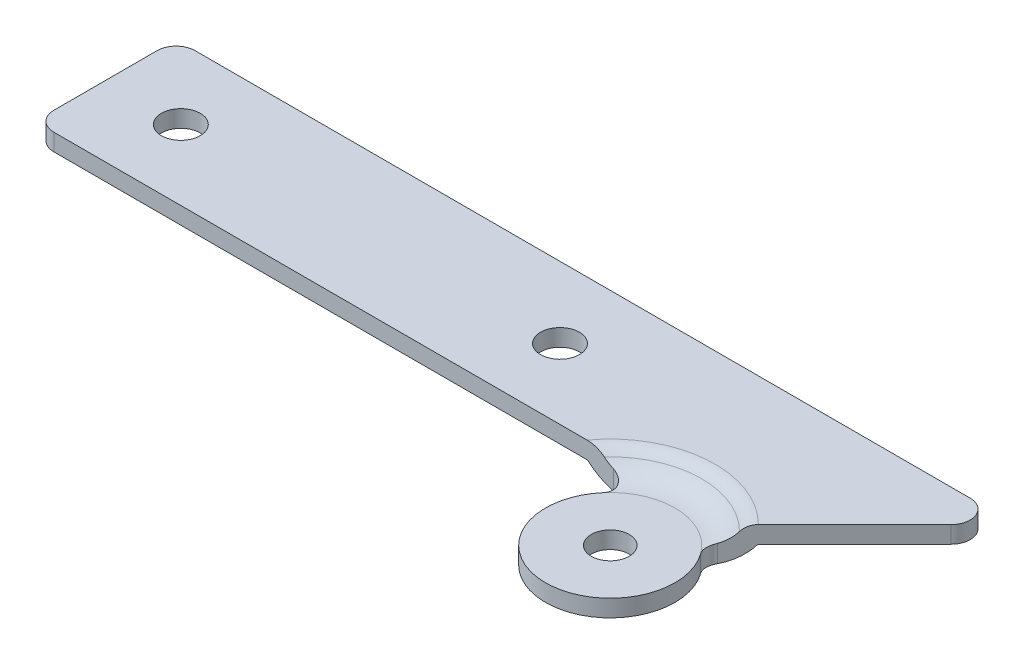
ISO-10303-21;
HEADER;
FILE_DESCRIPTION(('STEP AP214'),'2;1');
FILE_NAME('part.step','',(''),(''),'','','');
FILE_SCHEMA(('AUTOMOTIVE_DESIGN { 1 0 10303 214 1 1 1 1 }'));
ENDSEC;
DATA;
#1=APPLICATION_CONTEXT('core data for automotive mechanical design processes');
#2=APPLICATION_PROTOCOL_DEFINITION('international standard','automotive_design',2000,#1);
#3=PRODUCT_CONTEXT('',#1,'mechanical');
#4=PRODUCT('Part','Part','',(#3));
#5=PRODUCT_RELATED_PRODUCT_CATEGORY('part','',(#4));
#6=PRODUCT_DEFINITION_FORMATION('','',#4);
#7=PRODUCT_DEFINITION_CONTEXT('part definition',#1,'design');
#8=PRODUCT_DEFINITION('design','',#6,#7);
#9=PRODUCT_DEFINITION_SHAPE('','',#8);
#10=(LENGTH_UNIT() NAMED_UNIT(*) SI_UNIT(.MILLI.,.METRE.));
#11=(NAMED_UNIT(*) PLANE_ANGLE_UNIT() SI_UNIT($,.RADIAN.));
#12=(NAMED_UNIT(*) SI_UNIT($,.STERADIAN.) SOLID_ANGLE_UNIT());
#13=UNCERTAINTY_MEASURE_WITH_UNIT(LENGTH_MEASURE(1.E-05),#10,'distance_accuracy_value','');
#14=(GEOMETRIC_REPRESENTATION_CONTEXT(3) GLOBAL_UNCERTAINTY_ASSIGNED_CONTEXT((#13)) GLOBAL_UNIT_ASSIGNED_CONTEXT((#10,
#11,#12)) REPRESENTATION_CONTEXT('',''));
#15=CARTESIAN_POINT('',(0.,0.,0.));
#16=DIRECTION('',(0.,0.,1.));
#17=DIRECTION('',(1.,0.,0.));
#18=AXIS2_PLACEMENT_3D('',#15,#16,#17);
#19=CARTESIAN_POINT('',(44.4503952922486,-3.13962266922809,17.653));
#20=DIRECTION('',(0.,1.,0.));
#21=DIRECTION('',(0.,0.,1.));
#22=AXIS2_PLACEMENT_3D('',#19,#20,#21);
#23=CYLINDRICAL_SURFACE('',#22,2.54);
#24=CARTESIAN_POINT('',(44.4503952922486,-0.12700000003041,17.653));
#25=DIRECTION('',(0.,1.,0.));
#26=DIRECTION('',(0.,0.,1.));
#27=AXIS2_PLACEMENT_3D('',#24,#25,#26);
#28=CIRCLE('',#27,2.54);
#29=CARTESIAN_POINT('',(44.4503952922486,-0.12700000003041,20.193));
#30=VERTEX_POINT('',#29);
#31=EDGE_CURVE('E20',#30,#30,#28,.T.);
#32=ORIENTED_EDGE('',*,*,#31,.T.);
#33=EDGE_LOOP('',(#32));
#34=FACE_BOUND('',#33,.T.);
#35=CARTESIAN_POINT('',(44.4503952922486,-2.41300000003041,17.653));
#36=DIRECTION('',(0.,1.,0.));
#37=DIRECTION('',(0.,0.,1.));
#38=AXIS2_PLACEMENT_3D('',#35,#36,#37);
#39=CIRCLE('',#38,2.54);
#40=CARTESIAN_POINT('',(44.4503952922486,-2.41300000003041,20.193));
#41=VERTEX_POINT('',#40);
#42=EDGE_CURVE('E316',#41,#41,#39,.T.);
#43=ORIENTED_EDGE('',*,*,#42,.F.);
#44=EDGE_LOOP('',(#43));
#45=FACE_BOUND('',#44,.T.);
#46=ADVANCED_FACE('F17',(#34,#45),#23,.F.);
#47=CARTESIAN_POINT('',(44.4503952922486,-0.12700000003041,17.653));
#48=DIRECTION('',(0.,-1.,0.));
#49=DIRECTION('',(0.,0.,-1.));
#50=AXIS2_PLACEMENT_3D('',#47,#48,#49);
#51=PLANE('',#50);
#52=ORIENTED_EDGE('',*,*,#31,.F.);
#53=EDGE_LOOP('',(#52));
#54=FACE_BOUND('',#53,.T.);
#55=CARTESIAN_POINT('',(44.4503952922486,-0.12700000003041,17.653));
#56=DIRECTION('',(0.,-1.,0.));
#57=DIRECTION('',(-0.760302428804956,0.,-0.649569254778337));
#58=AXIS2_PLACEMENT_3D('',#55,#56,#57);
#59=CIRCLE('',#58,8.67699443373867);
#60=CARTESIAN_POINT('',(51.4610548897929,-0.12700000003041,12.54018429723));
#61=VERTEX_POINT('',#60);
#62=CARTESIAN_POINT('',(37.85325534955,-0.12700000003041,12.0166911919606));
#63=VERTEX_POINT('',#62);
#64=EDGE_CURVE('E130',#61,#63,#59,.F.);
#65=ORIENTED_EDGE('',*,*,#64,.T.);
#66=CARTESIAN_POINT('',(44.4503952922486,-0.12700000003041,17.653));
#67=DIRECTION('',(0.,1.,0.));
#68=DIRECTION('',(0.,0.,1.));
#69=AXIS2_PLACEMENT_3D('',#66,#67,#68);
#70=CIRCLE('',#69,8.67699443373867);
#71=EDGE_CURVE('E435',#61,#63,#70,.F.);
#72=ORIENTED_EDGE('',*,*,#71,.F.);
#73=EDGE_LOOP('',(#65,#72));
#74=FACE_BOUND('',#73,.T.);
#75=ADVANCED_FACE('F275',(#54,#74),#51,.F.);
#76=CARTESIAN_POINT('',(44.4503952922486,-2.41300000003041,17.653));
#77=DIRECTION('',(0.,1.,0.));
#78=DIRECTION('',(0.,0.,1.));
#79=AXIS2_PLACEMENT_3D('',#76,#77,#78);
#80=CYLINDRICAL_SURFACE('',#79,8.67699443373867);
#81=DIRECTION('',(0.,1.,0.));
#82=VECTOR('',#81,1.);
#83=CARTESIAN_POINT('',(51.4610548897929,-2.41300000003041,12.54018429723));
#84=LINE('',#83,#82);
#85=CARTESIAN_POINT('',(51.4610548897929,-2.41300000003041,12.54018429723));
#86=VERTEX_POINT('',#85);
#87=EDGE_CURVE('E137',#86,#61,#84,.T.);
#88=ORIENTED_EDGE('',*,*,#87,.T.);
#89=ORIENTED_EDGE('',*,*,#71,.T.);
#90=DIRECTION('',(0.,1.,0.));
#91=VECTOR('',#90,1.);
#92=CARTESIAN_POINT('',(37.85325534955,-2.41300000003041,12.0166911919606));
#93=LINE('',#92,#91);
#94=CARTESIAN_POINT('',(37.85325534955,-2.41300000003041,12.0166911919606));
#95=VERTEX_POINT('',#94);
#96=EDGE_CURVE('E313',#63,#95,#93,.F.);
#97=ORIENTED_EDGE('',*,*,#96,.T.);
#98=CARTESIAN_POINT('',(44.4503952922486,-2.41300000003041,17.653));
#99=DIRECTION('',(0.,1.,0.));
#100=DIRECTION('',(0.,0.,1.));
#101=AXIS2_PLACEMENT_3D('',#98,#99,#100);
#102=CIRCLE('',#101,8.67699443373867);
#103=EDGE_CURVE('E433',#86,#95,#102,.F.);
#104=ORIENTED_EDGE('',*,*,#103,.F.);
#105=EDGE_LOOP('',(#88,#89,#97,#104));
#106=FACE_BOUND('',#105,.T.);
#107=ADVANCED_FACE('F270',(#106),#80,.T.);
#108=CARTESIAN_POINT('',(44.4503952922486,-2.41300000003041,17.653));
#109=DIRECTION('',(0.,-1.,0.));
#110=DIRECTION('',(0.,0.,-1.));
#111=AXIS2_PLACEMENT_3D('',#108,#109,#110);
#112=PLANE('',#111);
#113=ORIENTED_EDGE('',*,*,#42,.T.);
#114=EDGE_LOOP('',(#113));
#115=FACE_BOUND('',#114,.T.);
#116=CARTESIAN_POINT('',(44.4503952922486,-2.41300000003041,17.653));
#117=DIRECTION('',(0.,1.,0.));
#118=DIRECTION('',(0.807959443915839,0.,-0.589238098723435));
#119=AXIS2_PLACEMENT_3D('',#116,#117,#118);
#120=CIRCLE('',#119,8.67699443373866);
#121=EDGE_CURVE('E253',#86,#95,#120,.T.);
#122=ORIENTED_EDGE('',*,*,#121,.F.);
#123=ORIENTED_EDGE('',*,*,#103,.T.);
#124=EDGE_LOOP('',(#122,#123));
#125=FACE_BOUND('',#124,.T.);
#126=ADVANCED_FACE('F259',(#115,#125),#112,.T.);
#127=CARTESIAN_POINT('',(36.6462752438221,-2.41300000003041,10.9855));
#128=DIRECTION('',(0.,1.,0.));
#129=DIRECTION('',(0.,0.,1.));
#130=AXIS2_PLACEMENT_3D('',#127,#128,#129);
#131=CYLINDRICAL_SURFACE('',#130,1.5875);
#132=ORIENTED_EDGE('',*,*,#96,.F.);
#133=CARTESIAN_POINT('',(37.85325534955,-0.12700000003041,12.0166911919606));
#134=CARTESIAN_POINT('',(37.8822032619722,-0.12699357584352,11.9828149944831));
#135=CARTESIAN_POINT('',(37.9097169934397,-0.126999840282788,11.9477161730048));
#136=CARTESIAN_POINT('',(37.9616976655333,-0.126990895706065,11.8753325807003));
#137=CARTESIAN_POINT('',(37.9861647247903,-0.126975687526456,11.8380478950704));
#138=CARTESIAN_POINT('',(38.0318705702176,-0.126876965328563,11.7615581238861));
#139=CARTESIAN_POINT('',(38.0531101087453,-0.12679346725818,11.7223534887115));
#140=CARTESIAN_POINT('',(38.0922153861983,-0.126467953073541,11.6423106593733));
#141=CARTESIAN_POINT('',(38.1100811666746,-0.126225938911719,11.6014724853357));
#142=CARTESIAN_POINT('',(38.1584340754211,-0.125094248648951,11.4768781556044));
#143=CARTESIAN_POINT('',(38.1836898184842,-0.123799017271902,11.3910203137122));
#144=CARTESIAN_POINT('',(38.2194195073506,-0.118970644195672,11.2164140567206));
#145=CARTESIAN_POINT('',(38.2298989666648,-0.11543833793504,11.1276667324337));
#146=CARTESIAN_POINT('',(38.2358406703157,-0.104909760431675,10.9505536318909));
#147=CARTESIAN_POINT('',(38.2314200980152,-0.0979408857131835,10.8621903255012));
#148=CARTESIAN_POINT('',(38.2081038047483,-0.0794855849199816,10.6878781780898));
#149=CARTESIAN_POINT('',(38.1892092882199,-0.067999534777181,10.6019291367839));
#150=CARTESIAN_POINT('',(38.1384394074222,-0.040153215046412,10.4369723447442));
#151=CARTESIAN_POINT('',(38.1068658984526,-0.0239085163032391,10.3578518776138));
#152=CARTESIAN_POINT('',(38.0321417817778,0.0137000461974292,10.2066252996822));
#153=CARTESIAN_POINT('',(37.9889911410483,0.0350639245575904,10.1345192088904));
#154=CARTESIAN_POINT('',(37.8922844507806,0.0828945993898807,9.9982402392753));
#155=CARTESIAN_POINT('',(37.8386137644128,0.10941758782603,9.93416882326385));
#156=CARTESIAN_POINT('',(37.7231010537479,0.16674133326273,9.81612898052181));
#157=CARTESIAN_POINT('',(37.6612569264516,0.197543191306813,9.76216316259424));
#158=CARTESIAN_POINT('',(37.5262537654841,0.26501869039011,9.66133032935777));
#159=CARTESIAN_POINT('',(37.4525914424129,0.301961029216738,9.61531911989643));
#160=CARTESIAN_POINT('',(37.2998739869073,0.37852289602598,9.53623530121435));
#161=CARTESIAN_POINT('',(37.2208149359553,0.418144369103684,9.50317221342322));
#162=CARTESIAN_POINT('',(37.0602108257916,0.498101359430003,9.45061998494698));
#163=CARTESIAN_POINT('',(36.9787180008281,0.538418362156986,9.43094212398631));
#164=CARTESIAN_POINT('',(36.8137075956259,0.618767714248563,9.40465519505122));
#165=CARTESIAN_POINT('',(36.7301940832984,0.658800454737621,9.39802177595316));
#166=CARTESIAN_POINT('',(36.6462752438221,0.697999556154315,9.39799999999998));
#167=B_SPLINE_CURVE_WITH_KNOTS('',3,(#133,#134,#135,#136,#137,#138,#139,#140,#141,#142,#143,
#144,#145,#146,#147,#148,#149,#150,#151,#152,#153,#154,#155,#156,#157,#158,#159,#160,#161,#162,
#163,#164,#165,#166),.UNSPECIFIED.,.F.,.F.,(4,2,2,2,2,2,2,2,2,2,2,2,2,2,2,2,4),(0.,
0.133636146836537,0.267267088533071,0.400866831984319,0.53446492992592,0.801585666559904,
1.06860670538079,1.33353263588604,1.59843652318217,1.85737584270882,2.1163159008791,
2.37825251779267,2.64025666181482,2.92225163565687,3.20445358748349,3.48258934043794,
3.76020537993433),.UNSPECIFIED.);
#168=CARTESIAN_POINT('',(36.6462752438221,0.697999556154314,9.39799999999999));
#169=VERTEX_POINT('',#168);
#170=EDGE_CURVE('E413',#63,#169,#167,.T.);
#171=ORIENTED_EDGE('',*,*,#170,.T.);
#172=DIRECTION('',(0.,1.,0.));
#173=VECTOR('',#172,1.);
#174=CARTESIAN_POINT('',(36.6462752438221,2.286,9.39799999999999));
#175=LINE('',#174,#173);
#176=CARTESIAN_POINT('',(36.6462752438221,-1.88342261208621,9.39799999999999));
#177=VERTEX_POINT('',#176);
#178=EDGE_CURVE('E193',#177,#169,#175,.T.);
#179=ORIENTED_EDGE('',*,*,#178,.F.);
#180=CARTESIAN_POINT('',(37.85325534955,-2.41300000003041,12.0166911919606));
#181=CARTESIAN_POINT('',(37.8822399801254,-2.41299656145982,11.9827650366654));
#182=CARTESIAN_POINT('',(37.9097798997594,-2.41300035391785,11.9476326896234));
#183=CARTESIAN_POINT('',(37.96180592947,-2.41299335372206,11.87517769664));
#184=CARTESIAN_POINT('',(37.9862921732067,-2.41298256170685,11.8378551466695));
#185=CARTESIAN_POINT('',(38.0548639607022,-2.41288483491481,11.7230369835564));
#186=CARTESIAN_POINT('',(38.0941438961141,-2.41273270090005,11.6425954690924));
#187=CARTESIAN_POINT('',(38.1586507183666,-2.41170395339247,11.4762632866642));
#188=CARTESIAN_POINT('',(38.183870193205,-2.41082695839116,11.3903697711881));
#189=CARTESIAN_POINT('',(38.2195374965038,-2.40755355376761,11.2156046156913));
#190=CARTESIAN_POINT('',(38.2299893395239,-2.40515755734045,11.1267337917753));
#191=CARTESIAN_POINT('',(38.2358361307235,-2.39800351885394,10.9489131377669));
#192=CARTESIAN_POINT('',(38.231285291383,-2.39325403393996,10.8599647507378));
#193=CARTESIAN_POINT('',(38.2074540726679,-2.38065918723953,10.6842794011772));
#194=CARTESIAN_POINT('',(38.1881732038192,-2.37281372257888,10.597542512232));
#195=CARTESIAN_POINT('',(38.1358828502528,-2.3536477433091,10.4297415081447));
#196=CARTESIAN_POINT('',(38.103020787721,-2.34236487683622,10.3486270799451));
#197=CARTESIAN_POINT('',(38.0247563161692,-2.31615995088939,10.1933470159968));
#198=CARTESIAN_POINT('',(37.97935429845,-2.30123800497215,10.119181163519));
#199=CARTESIAN_POINT('',(37.8772356197002,-2.26785424035333,9.97929991995353));
#200=CARTESIAN_POINT('',(37.8204520258506,-2.24937150758591,9.91363849131462));
#201=CARTESIAN_POINT('',(37.6975248365339,-2.20942785197899,9.7928301107711));
#202=CARTESIAN_POINT('',(37.6313793175245,-2.18796631711929,9.73768532514178));
#203=CARTESIAN_POINT('',(37.4889757435167,-2.14195097181251,9.63720877673361));
#204=CARTESIAN_POINT('',(37.4124314802008,-2.11731137977342,9.59232256416344));
#205=CARTESIAN_POINT('',(37.2533390009948,-2.06661146026913,9.51600528390614));
#206=CARTESIAN_POINT('',(37.1707903710161,-2.04055103484788,9.48457514524246));
#207=CARTESIAN_POINT('',(37.0149126795996,-1.99222809275234,9.43960843656497));
#208=CARTESIAN_POINT('',(36.9421471130521,-1.97000543455366,9.4240488670552));
#209=CARTESIAN_POINT('',(36.795083077898,-1.92611915795541,9.40324552473372));
#210=CARTESIAN_POINT('',(36.7207864028513,-1.90445494568515,9.39799030609377));
#211=CARTESIAN_POINT('',(36.6462752438221,-1.88342261208621,9.39799999999998));
#212=B_SPLINE_CURVE_WITH_KNOTS('',3,(#180,#181,#182,#183,#184,#185,#186,#187,#188,#189,#190,
#191,#192,#193,#194,#195,#196,#197,#198,#199,#200,#201,#202,#203,#204,#205,#206,#207,#208,#209,
#210,#211),.UNSPECIFIED.,.F.,.F.,(4,2,2,2,2,2,2,2,2,2,2,2,2,2,2,4),(0.,0.133782854775079,
0.267559851789285,0.534742553649619,0.802065968599256,1.06931669806774,1.3356027719386,
1.6018976947931,1.86537493105363,2.1288439466127,2.39391040206322,2.65903139850863,
2.93409470785859,3.20917700484736,3.44146576522841,3.67349635827377),.UNSPECIFIED.);
#213=EDGE_CURVE('E394',#95,#177,#212,.T.);
#214=ORIENTED_EDGE('',*,*,#213,.F.);
#215=EDGE_LOOP('',(#132,#171,#179,#214));
#216=FACE_BOUND('',#215,.T.);
#217=ADVANCED_FACE('F269',(#216),#131,.F.);
#218=CARTESIAN_POINT('',(44.4503952922486,4.64819999996959,17.653));
#219=DIRECTION('',(0.,1.,0.));
#220=DIRECTION('',(0.,0.,1.));
#221=AXIS2_PLACEMENT_3D('',#218,#219,#220);
#222=TOROIDAL_SURFACE('',#221,8.67699443373867,4.7752);
#223=CARTESIAN_POINT('',(44.4503952922486,1.48166666663626,17.653));
#224=DIRECTION('',(0.,1.,0.));
#225=DIRECTION('',(0.,0.,1.));
#226=AXIS2_PLACEMENT_3D('',#223,#224,#225);
#227=CIRCLE('',#226,12.2512918036967);
#228=CARTESIAN_POINT('',(35.3978196444384,1.48166666663626,9.39799999999999));
#229=VERTEX_POINT('',#228);
#230=CARTESIAN_POINT('',(53.1133668049377,1.48166666663626,8.99002848731088));
#231=VERTEX_POINT('',#230);
#232=EDGE_CURVE('E215',#229,#231,#227,.F.);
#233=ORIENTED_EDGE('',*,*,#232,.F.);
#234=CARTESIAN_POINT('',(36.6462752438221,0.697999556154315,9.39799999999998));
#235=CARTESIAN_POINT('',(36.5902691154025,0.724131846142782,9.39799999999999));
#236=CARTESIAN_POINT('',(36.5346331071177,0.75106198866906,9.39799999999999));
#237=CARTESIAN_POINT('',(36.4243419247119,0.806465591426125,9.39799999999999));
#238=CARTESIAN_POINT('',(36.3696843301863,0.834934235464384,9.39799999999999));
#239=CARTESIAN_POINT('',(36.2613709557785,0.893455789059646,9.39799999999999));
#240=CARTESIAN_POINT('',(36.2077133161656,0.92350525281748,9.39799999999999));
#241=CARTESIAN_POINT('',(36.1014240037671,0.985232372130987,9.39799999999999));
#242=CARTESIAN_POINT('',(36.0487912313239,1.01690813289203,9.39799999999999));
#243=CARTESIAN_POINT('',(35.9445605804883,1.08194764649301,9.39799999999999));
#244=CARTESIAN_POINT('',(35.8929629565739,1.1153118074722,9.39799999999999));
#245=CARTESIAN_POINT('',(35.7908560301176,1.18376895949815,9.39799999999999));
#246=CARTESIAN_POINT('',(35.7403478043849,1.21886355767911,9.39799999999999));
#247=CARTESIAN_POINT('',(35.640459396077,1.29083747221312,9.39799999999999));
#248=CARTESIAN_POINT('',(35.5910817612592,1.32772032800084,9.39799999999999));
#249=CARTESIAN_POINT('',(35.4934995257495,1.40333131706467,9.39799999999999));
#250=CARTESIAN_POINT('',(35.4452993329232,1.44206513717306,9.39799999999999));
#251=CARTESIAN_POINT('',(35.3978196444384,1.48166666663626,9.39799999999999));
#252=B_SPLINE_CURVE_WITH_KNOTS('',3,(#234,#235,#236,#237,#238,#239,#240,#241,#242,#243,#244,
#245,#246,#247,#248,#249,#250,#251),.UNSPECIFIED.,.F.,.F.,(4,2,2,2,2,2,2,2,4),(0.,
0.185404947511082,0.370259787606954,0.554727160050264,0.738984282775716,0.923286160990438,
1.10776255686209,1.29262030634037,1.47808797916946),.UNSPECIFIED.);
#253=EDGE_CURVE('E196',#169,#229,#252,.T.);
#254=ORIENTED_EDGE('',*,*,#253,.F.);
#255=ORIENTED_EDGE('',*,*,#170,.F.);
#256=ORIENTED_EDGE('',*,*,#64,.F.);
#257=CARTESIAN_POINT('',(51.4610548897929,-0.12700000003041,12.54018429723));
#258=CARTESIAN_POINT('',(51.4347952435241,-0.126993576169972,12.5041844237733));
#259=CARTESIAN_POINT('',(51.4100594557561,-0.126999840389627,12.4670757328376));
#260=CARTESIAN_POINT('',(51.3637935731327,-0.126990895771473,12.3909129511888));
#261=CARTESIAN_POINT('',(51.3422633536243,-0.126975687768884,12.3518589362012));
#262=CARTESIAN_POINT('',(51.3025689666508,-0.126876967346128,12.2720838432183));
#263=CARTESIAN_POINT('',(51.2844040455595,-0.126793470241382,12.2313631409614));
#264=CARTESIAN_POINT('',(51.2515635702301,-0.12646795458767,12.148552186645));
#265=CARTESIAN_POINT('',(51.236887972795,-0.126225938001275,12.1064619515473));
#266=CARTESIAN_POINT('',(51.1982494269307,-0.125094236049684,11.9785188763009));
#267=CARTESIAN_POINT('',(51.179664163295,-0.123798984730494,11.890972393628));
#268=CARTESIAN_POINT('',(51.1574552766642,-0.118970447290142,11.7141369859358));
#269=CARTESIAN_POINT('',(51.1538253635298,-0.115438102799588,11.6248488093434));
#270=CARTESIAN_POINT('',(51.1615071822012,-0.104910519918037,11.4478162466703));
#271=CARTESIAN_POINT('',(51.1727004199007,-0.0979430199973769,11.3600652312143));
#272=CARTESIAN_POINT('',(51.2093376710495,-0.079488046182522,11.1880570011627));
#273=CARTESIAN_POINT('',(51.2347840348522,-0.067999826910597,11.1038003652552));
#274=CARTESIAN_POINT('',(51.2980937114425,-0.0401463988706432,10.9431802392321));
#275=CARTESIAN_POINT('',(51.3356708284695,-0.0238943252310592,10.8666836617983));
#276=CARTESIAN_POINT('',(51.4218273784822,0.0137310345407412,10.7216306995218));
#277=CARTESIAN_POINT('',(51.4703936250435,0.0350981845956175,10.6530649458814));
#278=CARTESIAN_POINT('',(51.5390102706255,0.0658000581678463,10.5706039560829));
#279=CARTESIAN_POINT('',(51.5549481803034,0.0729625340841673,10.5523264539436));
#280=CARTESIAN_POINT('',(51.5875287303717,0.0876713433967778,10.5166388806914));
#281=CARTESIAN_POINT('',(51.6041700151685,0.0952169435970285,10.4992272702198));
#282=CARTESIAN_POINT('',(51.6211584918745,0.102955193081931,10.482236800372));
#283=B_SPLINE_CURVE_WITH_KNOTS('',3,(#257,#258,#259,#260,#261,#262,#263,#264,#265,#266,#267,
#268,#269,#270,#271,#272,#273,#274,#275,#276,#277,#278,#279,#280,#281,#282),.UNSPECIFIED.,.F.,
.F.,(4,2,2,2,2,2,2,2,2,2,2,2,4),(0.,0.133635525210901,0.267265852455416,0.400866218203313,
0.534464929925057,0.801591999641598,1.06860670568735,1.33349976697926,1.5984365222408,
1.85753083598403,2.11631588249819,2.19215663343425,2.26785734769636),.UNSPECIFIED.);
#284=CARTESIAN_POINT('',(51.6211584918751,0.102955193081953,10.4822368003724));
#285=VERTEX_POINT('',#284);
#286=EDGE_CURVE('E126',#61,#285,#283,.T.);
#287=ORIENTED_EDGE('',*,*,#286,.T.);
#288=CARTESIAN_POINT('',(53.1133668049377,1.48166666663626,8.99002848731088));
#289=CARTESIAN_POINT('',(53.0497322459138,1.38006256996459,9.05366304633481));
#290=CARTESIAN_POINT('',(52.983019935166,1.28231635857511,9.12037535708255));
#291=CARTESIAN_POINT('',(52.8439397243861,1.09517938502789,9.25945556786241));
#292=CARTESIAN_POINT('',(52.7715703784005,1.00579077200134,9.33182491384807));
#293=CARTESIAN_POINT('',(52.623353614427,0.837923915497622,9.4800416778216));
#294=CARTESIAN_POINT('',(52.5476173819415,0.759249284267575,9.55577791030706));
#295=CARTESIAN_POINT('',(52.3918064495921,0.611125458109484,9.71158884265645));
#296=CARTESIAN_POINT('',(52.3117333955879,0.541672797430706,9.79166189666064));
#297=CARTESIAN_POINT('',(52.1336200102782,0.40129417684349,9.96977528197036));
#298=CARTESIAN_POINT('',(52.0348626495808,0.332179913405813,10.0685326426677));
#299=CARTESIAN_POINT('',(51.8317276911468,0.207075407463629,10.2716676011018));
#300=CARTESIAN_POINT('',(51.7272932743001,0.151269649615786,10.3761020179485));
#301=CARTESIAN_POINT('',(51.6211584918757,0.102955193081979,10.4822368003729));
#302=B_SPLINE_CURVE_WITH_KNOTS('',3,(#288,#289,#290,#291,#292,#293,#294,#295,#296,#297,#298,
#299,#300,#301),.UNSPECIFIED.,.F.,.F.,(4,2,2,2,2,2,4),(0.,0.407058804524099,0.814221996750503,
1.21244954215881,1.61052700169594,2.07725848029542,2.55012599001393),.UNSPECIFIED.);
#303=EDGE_CURVE('E113',#231,#285,#302,.T.);
#304=ORIENTED_EDGE('',*,*,#303,.F.);
#305=EDGE_LOOP('',(#233,#254,#255,#256,#287,#304));
#306=FACE_BOUND('',#305,.T.);
#307=ADVANCED_FACE('F127',(#306),#222,.F.);
#308=CARTESIAN_POINT('',(52.7436905070093,-2.41300000003041,11.6047688155066));
#309=DIRECTION('',(0.,1.,0.));
#310=DIRECTION('',(0.,0.,1.));
#311=AXIS2_PLACEMENT_3D('',#308,#309,#310);
#312=CYLINDRICAL_SURFACE('',#311,1.5875);
#313=DIRECTION('',(0.,1.,0.));
#314=VECTOR('',#313,1.);
#315=CARTESIAN_POINT('',(51.6211584918757,2.286,10.4822368003729));
#316=LINE('',#315,#314);
#317=CARTESIAN_POINT('',(51.6211584918757,-2.2595681457153,10.4822368003729));
#318=VERTEX_POINT('',#317);
#319=EDGE_CURVE('E117',#285,#318,#316,.F.);
#320=ORIENTED_EDGE('',*,*,#319,.F.);
#321=ORIENTED_EDGE('',*,*,#286,.F.);
#322=ORIENTED_EDGE('',*,*,#87,.F.);
#323=CARTESIAN_POINT('',(51.6211584918757,-2.2595681457153,10.4822368003729));
#324=CARTESIAN_POINT('',(51.590473619888,-2.26876697908094,10.5129219730938));
#325=CARTESIAN_POINT('',(51.5609983477627,-2.27754895503426,10.5449152356508));
#326=CARTESIAN_POINT('',(51.5046702811015,-2.29424437852611,10.6113483941292));
#327=CARTESIAN_POINT('',(51.4778177321217,-2.30215774474841,10.645788518621));
#328=CARTESIAN_POINT('',(51.4015779054809,-2.32451956228859,10.7524172687029));
#329=CARTESIAN_POINT('',(51.3564223107895,-2.33761541005459,10.8280002430247));
#330=CARTESIAN_POINT('',(51.2790519676684,-2.36014179061674,10.9860973119358));
#331=CARTESIAN_POINT('',(51.2468526373931,-2.36956795600374,11.0686195240354));
#332=CARTESIAN_POINT('',(51.1965846773915,-2.3850724631475,11.2381270113683));
#333=CARTESIAN_POINT('',(51.1785091938078,-2.39115242828565,11.3251101000135));
#334=CARTESIAN_POINT('',(51.1572185821755,-2.40055201739991,11.5001000445791));
#335=CARTESIAN_POINT('',(51.153852626479,-2.40389937032047,11.5880871891045));
#336=CARTESIAN_POINT('',(51.1617084664939,-2.40872871924282,11.7635186965492));
#337=CARTESIAN_POINT('',(51.1729400383739,-2.41020946384211,11.8509626562682));
#338=CARTESIAN_POINT('',(51.2098634905342,-2.41211759678412,12.0235745277887));
#339=CARTESIAN_POINT('',(51.235686899425,-2.41253521103583,12.1087142499874));
#340=CARTESIAN_POINT('',(51.3011535082902,-2.41297114569377,12.2733996922009));
#341=CARTESIAN_POINT('',(51.3407716375562,-2.41299018666137,12.3529552479044));
#342=CARTESIAN_POINT('',(51.3982751203639,-2.41299849800293,12.4476911652213));
#343=CARTESIAN_POINT('',(51.4102926338021,-2.41299938180028,12.4665744242925));
#344=CARTESIAN_POINT('',(51.4350975658723,-2.41300022059359,12.5037895874197));
#345=CARTESIAN_POINT('',(51.4478838659454,-2.41300017690788,12.5221222369806));
#346=CARTESIAN_POINT('',(51.4610548897927,-2.41300000003041,12.5401842972301));
#347=B_SPLINE_CURVE_WITH_KNOTS('',3,(#323,#324,#325,#326,#327,#328,#329,#330,#331,#332,#333,
#334,#335,#336,#337,#338,#339,#340,#341,#342,#343,#344,#345,#346),.UNSPECIFIED.,.F.,.F.,(4,2,2,
2,2,2,2,2,2,2,2,4),(0.,0.133002458630632,0.26601735789049,0.531678698952267,0.797655252717396,
1.06350265615487,1.32661763670419,1.5899089198722,1.85561222044711,2.12083512729617,
2.18797227958885,2.25501400848879),.UNSPECIFIED.);
#348=EDGE_CURVE('E136',#318,#86,#347,.T.);
#349=ORIENTED_EDGE('',*,*,#348,.F.);
#350=EDGE_LOOP('',(#320,#321,#322,#349));
#351=FACE_BOUND('',#350,.T.);
#352=ADVANCED_FACE('F139',(#351),#312,.F.);
#353=CARTESIAN_POINT('',(44.4503952922486,4.64819999996959,17.653));
#354=DIRECTION('',(0.,1.,0.));
#355=DIRECTION('',(0.,0.,1.));
#356=AXIS2_PLACEMENT_3D('',#353,#354,#355);
#357=TOROIDAL_SURFACE('',#356,8.67699443373867,7.0612);
#358=ORIENTED_EDGE('',*,*,#213,.T.);
#359=CARTESIAN_POINT('',(33.1896957390191,-0.0342269503850164,9.398));
#360=CARTESIAN_POINT('',(33.309184548041,-0.143019797463722,9.39799999999999));
#361=CARTESIAN_POINT('',(33.4323359881504,-0.247746106593866,9.39799999999999));
#362=CARTESIAN_POINT('',(33.6850299171103,-0.448839717821115,9.39799999999999));
#363=CARTESIAN_POINT('',(33.8145639502821,-0.545217636345454,9.39799999999999));
#364=CARTESIAN_POINT('',(34.0793623331157,-0.729642735477888,9.39799999999999));
#365=CARTESIAN_POINT('',(34.2146249833065,-0.817692362067445,9.39799999999999));
#366=CARTESIAN_POINT('',(34.4877291969917,-0.984025218323826,9.39799999999999));
#367=CARTESIAN_POINT('',(34.6254821375913,-1.06245426802723,9.39799999999999));
#368=CARTESIAN_POINT('',(34.9052000583578,-1.21144169194825,9.39799999999999));
#369=CARTESIAN_POINT('',(35.0471657040402,-1.28199881410246,9.39799999999999));
#370=CARTESIAN_POINT('',(35.3346214859613,-1.4153843694714,9.39799999999999));
#371=CARTESIAN_POINT('',(35.4801105492538,-1.47821512095203,9.39799999999999));
#372=CARTESIAN_POINT('',(35.7930413014898,-1.60403701838155,9.39799999999999));
#373=CARTESIAN_POINT('',(35.9608940437835,-1.66600354427327,9.39799999999999));
#374=CARTESIAN_POINT('',(36.3008479467168,-1.78128114646283,9.39799999999999));
#375=CARTESIAN_POINT('',(36.472970464693,-1.83452937873956,9.39799999999999));
#376=CARTESIAN_POINT('',(36.6462752438221,-1.8834226120862,9.39799999999999));
#377=B_SPLINE_CURVE_WITH_KNOTS('',3,(#359,#360,#361,#362,#363,#364,#365,#366,#367,#368,#369,
#370,#371,#372,#373,#374,#375,#376),.UNSPECIFIED.,.F.,.F.,(4,2,2,2,2,2,2,2,4),(0.,
0.484654534646943,0.968683410578138,1.45256968513056,1.92785184280186,2.40320948866393,
2.87842415558414,3.41493394637438,3.95515531087969),.UNSPECIFIED.);
#378=CARTESIAN_POINT('',(33.1896957390191,-0.0342269503850147,9.39799999999999));
#379=VERTEX_POINT('',#378);
#380=EDGE_CURVE('E197',#379,#177,#377,.T.);
#381=ORIENTED_EDGE('',*,*,#380,.F.);
#382=CARTESIAN_POINT('',(44.4503952922486,-0.0342269503850148,17.653));
#383=DIRECTION('',(0.,1.,0.));
#384=DIRECTION('',(0.,0.,1.));
#385=AXIS2_PLACEMENT_3D('',#382,#383,#384);
#386=CIRCLE('',#385,13.9623916084638);
#387=CARTESIAN_POINT('',(54.3232970801755,-0.0342269503850164,7.78009821207306));
#388=VERTEX_POINT('',#387);
#389=EDGE_CURVE('E123',#379,#388,#386,.F.);
#390=ORIENTED_EDGE('',*,*,#389,.T.);
#391=CARTESIAN_POINT('',(51.6211584918757,-2.2595681457153,10.4822368003729));
#392=CARTESIAN_POINT('',(51.7603045683477,-2.21788674236586,10.3430907239009));
#393=CARTESIAN_POINT('',(51.8981838577658,-2.16775303561884,10.2052114344828));
#394=CARTESIAN_POINT('',(52.1704197812672,-2.05104424876379,9.9329755109814));
#395=CARTESIAN_POINT('',(52.3047763870229,-1.9844690364869,9.79861890522568));
#396=CARTESIAN_POINT('',(52.5655308538123,-1.83728554838523,9.53786443843621));
#397=CARTESIAN_POINT('',(52.6920448910463,-1.75708848162003,9.41135040120231));
#398=CARTESIAN_POINT('',(52.9399093043177,-1.58210651779362,9.16348598793087));
#399=CARTESIAN_POINT('',(53.0612603380869,-1.48732348603135,9.04213495416165));
#400=CARTESIAN_POINT('',(53.284879545404,-1.29507683956904,8.81851574684457));
#401=CARTESIAN_POINT('',(53.3877745398704,-1.19906708567755,8.71562075237821));
#402=CARTESIAN_POINT('',(53.5882639786792,-0.996549887399507,8.51513131356939));
#403=CARTESIAN_POINT('',(53.6858584926346,-0.89004258093248,8.41753679961399));
#404=CARTESIAN_POINT('',(53.8774625710033,-0.664457128941352,8.22593272124522));
#405=CARTESIAN_POINT('',(53.9713316036532,-0.545140192599588,8.13206368859531));
#406=CARTESIAN_POINT('',(54.1524306431355,-0.296792408721661,7.95096464911301));
#407=CARTESIAN_POINT('',(54.2396598260079,-0.167760359545339,7.86373546624067));
#408=CARTESIAN_POINT('',(54.3232970801755,-0.0342269503850207,7.78009821207306));
#409=B_SPLINE_CURVE_WITH_KNOTS('',3,(#391,#392,#393,#394,#395,#396,#397,#398,#399,#400,#401,
#402,#403,#404,#405,#406,#407,#408),.UNSPECIFIED.,.F.,.F.,(4,2,2,2,2,2,2,2,4),(0.,
0.603261737167172,1.20652832395202,1.79406362940766,2.38152386134998,2.90406148649677,
3.42659224732593,3.96155470220782,4.4965834344205),.UNSPECIFIED.);
#410=EDGE_CURVE('E142',#318,#388,#409,.T.);
#411=ORIENTED_EDGE('',*,*,#410,.F.);
#412=ORIENTED_EDGE('',*,*,#348,.T.);
#413=ORIENTED_EDGE('',*,*,#121,.T.);
#414=EDGE_LOOP('',(#358,#381,#390,#411,#412,#413));
#415=FACE_BOUND('',#414,.T.);
#416=ADVANCED_FACE('F402',(#415),#357,.T.);
#417=CARTESIAN_POINT('',(44.4503952922486,2.286,17.653));
#418=DIRECTION('',(0.,1.,0.));
#419=DIRECTION('',(0.,0.,1.));
#420=AXIS2_PLACEMENT_3D('',#417,#418,#419);
#421=PLANE('',#420);
#422=CARTESIAN_POINT('',(-30.734,2.286,0.));
#423=DIRECTION('',(0.,1.,0.));
#424=DIRECTION('',(0.,0.,1.));
#425=AXIS2_PLACEMENT_3D('',#422,#423,#424);
#426=CIRCLE('',#425,2.6035);
#427=CARTESIAN_POINT('',(-30.734,2.286,2.6035));
#428=VERTEX_POINT('',#427);
#429=EDGE_CURVE('E387',#428,#428,#426,.F.);
#430=ORIENTED_EDGE('',*,*,#429,.T.);
#431=EDGE_LOOP('',(#430));
#432=FACE_BOUND('',#431,.T.);
#433=CARTESIAN_POINT('',(20.066,2.286,0.));
#434=DIRECTION('',(0.,1.,0.));
#435=DIRECTION('',(0.,0.,1.));
#436=AXIS2_PLACEMENT_3D('',#433,#434,#435);
#437=CIRCLE('',#436,2.6035);
#438=CARTESIAN_POINT('',(20.066,2.286,2.6035));
#439=VERTEX_POINT('',#438);
#440=EDGE_CURVE('E385',#439,#439,#437,.F.);
#441=ORIENTED_EDGE('',*,*,#440,.T.);
#442=EDGE_LOOP('',(#441));
#443=FACE_BOUND('',#442,.T.);
#444=CARTESIAN_POINT('',(-38.3536047077515,2.286,6.858));
#445=DIRECTION('',(0.,1.,0.));
#446=DIRECTION('',(0.,0.,1.));
#447=AXIS2_PLACEMENT_3D('',#444,#445,#446);
#448=CIRCLE('',#447,2.54);
#449=CARTESIAN_POINT('',(-38.3536047077515,2.286,9.398));
#450=VERTEX_POINT('',#449);
#451=CARTESIAN_POINT('',(-40.8936047077515,2.286,6.858));
#452=VERTEX_POINT('',#451);
#453=EDGE_CURVE('E202',#450,#452,#448,.F.);
#454=ORIENTED_EDGE('',*,*,#453,.F.);
#455=DIRECTION('',(1.,0.,0.));
#456=VECTOR('',#455,1.);
#457=CARTESIAN_POINT('',(41.1508385038299,2.286,9.39799999999999));
#458=LINE('',#457,#456);
#459=CARTESIAN_POINT('',(33.0955379019469,2.28599999998784,9.39799999999999));
#460=VERTEX_POINT('',#459);
#461=EDGE_CURVE('E182',#460,#450,#458,.F.);
#462=ORIENTED_EDGE('',*,*,#461,.F.);
#463=CARTESIAN_POINT('',(44.4503952922486,2.28599999996959,17.653));
#464=DIRECTION('',(0.,1.,0.));
#465=DIRECTION('',(0.707106781186546,0.,-0.707106781186549));
#466=AXIS2_PLACEMENT_3D('',#463,#464,#465);
#467=CIRCLE('',#466,14.0384404886757);
#468=CARTESIAN_POINT('',(54.377071759075,2.28599999998784,7.7263235331736));
#469=VERTEX_POINT('',#468);
#470=EDGE_CURVE('E388',#469,#460,#467,.T.);
#471=ORIENTED_EDGE('',*,*,#470,.F.);
#472=DIRECTION('',(0.707106781186546,0.,-0.707106781186549));
#473=VECTOR('',#472,1.);
#474=CARTESIAN_POINT('',(50.736574576997,2.286,11.3668207152516));
#475=LINE('',#474,#473);
#476=CARTESIAN_POINT('',(67.2923440680347,2.286,-5.18894877578618));
#477=VERTEX_POINT('',#476);
#478=EDGE_CURVE('E152',#477,#469,#475,.F.);
#479=ORIENTED_EDGE('',*,*,#478,.F.);
#480=CARTESIAN_POINT('',(65.4962928438208,2.286,-6.985));
#481=DIRECTION('',(0.,1.,0.));
#482=DIRECTION('',(0.,0.,1.));
#483=AXIS2_PLACEMENT_3D('',#480,#481,#482);
#484=CIRCLE('',#483,2.54);
#485=CARTESIAN_POINT('',(65.4962928438208,2.286,-9.525));
#486=VERTEX_POINT('',#485);
#487=EDGE_CURVE('E212',#486,#477,#484,.F.);
#488=ORIENTED_EDGE('',*,*,#487,.F.);
#489=DIRECTION('',(-1.,0.,0.));
#490=VECTOR('',#489,1.);
#491=CARTESIAN_POINT('',(-40.8936047077515,2.286,-9.525));
#492=LINE('',#491,#490);
#493=CARTESIAN_POINT('',(-38.3536047077515,2.286,-9.525));
#494=VERTEX_POINT('',#493);
#495=EDGE_CURVE('E209',#494,#486,#492,.F.);
#496=ORIENTED_EDGE('',*,*,#495,.F.);
#497=CARTESIAN_POINT('',(-38.3536047077515,2.286,-6.985));
#498=DIRECTION('',(0.,1.,0.));
#499=DIRECTION('',(0.,0.,1.));
#500=AXIS2_PLACEMENT_3D('',#497,#498,#499);
#501=CIRCLE('',#500,2.54);
#502=CARTESIAN_POINT('',(-40.8936047077515,2.286,-6.985));
#503=VERTEX_POINT('',#502);
#504=EDGE_CURVE('E206',#503,#494,#501,.F.);
#505=ORIENTED_EDGE('',*,*,#504,.F.);
#506=DIRECTION('',(0.,0.,1.));
#507=VECTOR('',#506,1.);
#508=CARTESIAN_POINT('',(-40.8936047077515,2.286,9.398));
#509=LINE('',#508,#507);
#510=EDGE_CURVE('E203',#452,#503,#509,.F.);
#511=ORIENTED_EDGE('',*,*,#510,.F.);
#512=EDGE_LOOP('',(#454,#462,#471,#479,#488,#496,#505,#511));
#513=FACE_BOUND('',#512,.T.);
#514=ADVANCED_FACE('F224',(#432,#443,#513),#421,.T.);
#515=CARTESIAN_POINT('',(44.4503952922486,-0.10160000003041,17.653));
#516=DIRECTION('',(0.,1.,0.));
#517=DIRECTION('',(0.,0.,1.));
#518=AXIS2_PLACEMENT_3D('',#515,#516,#517);
#519=TOROIDAL_SURFACE('',#518,14.0384404886757,2.3876);
#520=ORIENTED_EDGE('',*,*,#470,.T.);
#521=CARTESIAN_POINT('',(35.3978196444384,1.48166666663626,9.39799999999999));
#522=CARTESIAN_POINT('',(35.318459490364,1.54781254818349,9.39799999999999));
#523=CARTESIAN_POINT('',(35.2357608541375,1.60982719854078,9.39799999999999));
#524=CARTESIAN_POINT('',(35.0649164532028,1.72561433893596,9.39799999999999));
#525=CARTESIAN_POINT('',(34.9767774672605,1.77939680668766,9.39799999999999));
#526=CARTESIAN_POINT('',(34.7985543490562,1.87754002429786,9.39799999999999));
#527=CARTESIAN_POINT('',(34.7085893895245,1.92211826885084,9.39799999999999));
#528=CARTESIAN_POINT('',(34.5252847288344,2.00368333567142,9.39799999999999));
#529=CARTESIAN_POINT('',(34.4319438150998,2.04066739776254,9.39799999999998));
#530=CARTESIAN_POINT('',(34.1411229712526,2.14255539578408,9.39799999999998));
#531=CARTESIAN_POINT('',(33.9390615954929,2.19500056907658,9.39799999999999));
#532=CARTESIAN_POINT('',(33.6288845458628,2.24889657113773,9.39799999999999));
#533=CARTESIAN_POINT('',(33.5227257818189,2.26274322949401,9.39799999999999));
#534=CARTESIAN_POINT('',(33.3095865893164,2.28128732758038,9.39799999999999));
#535=CARTESIAN_POINT('',(33.202605955869,2.28598240510563,9.39799999999999));
#536=CARTESIAN_POINT('',(33.0955379019469,2.28599999996959,9.39799999999999));
#537=B_SPLINE_CURVE_WITH_KNOTS('',3,(#521,#522,#523,#524,#525,#526,#527,#528,#529,#530,#531,
#532,#533,#534,#535,#536),.UNSPECIFIED.,.F.,.F.,(4,2,2,2,2,2,2,4),(0.,0.309680460000033,
0.618982551743188,0.91982326427694,1.22077312738179,1.84368043914905,2.16453455196528,
2.48547147264133),.UNSPECIFIED.);
#538=EDGE_CURVE('E190',#229,#460,#537,.T.);
#539=ORIENTED_EDGE('',*,*,#538,.F.);
#540=ORIENTED_EDGE('',*,*,#232,.T.);
#541=CARTESIAN_POINT('',(54.377071759075,2.28599999996959,7.7263235331736));
#542=CARTESIAN_POINT('',(54.3296044364467,2.28600651262537,7.77379085580185));
#543=CARTESIAN_POINT('',(54.2821391848628,2.2831689999296,7.82125610738573));
#544=CARTESIAN_POINT('',(54.1875468070952,2.27185576056228,7.91584848515334));
#545=CARTESIAN_POINT('',(54.1404196734232,2.26338015915022,7.9629756188254));
#546=CARTESIAN_POINT('',(54.046835545991,2.24084061585375,8.05655974625754));
#547=CARTESIAN_POINT('',(54.0003785497991,2.22677669425396,8.10301674244947));
#548=CARTESIAN_POINT('',(53.9084796949122,2.19317381725238,8.19491559733638));
#549=CARTESIAN_POINT('',(53.8630377965392,2.17363507625558,8.2403574957094));
#550=CARTESIAN_POINT('',(53.7286553238736,2.10696115624211,8.37473996837495));
#551=CARTESIAN_POINT('',(53.6416430721546,2.05176467092183,8.461752220094));
#552=CARTESIAN_POINT('',(53.4755434039454,1.92155042580137,8.62785188830315));
#553=CARTESIAN_POINT('',(53.3964451368599,1.84656033251368,8.70695015538868));
#554=CARTESIAN_POINT('',(53.2847844714534,1.72024153702156,8.81861082079515));
#555=CARTESIAN_POINT('',(53.2484664620983,1.67541292772542,8.85492883015029));
#556=CARTESIAN_POINT('',(53.1787143665815,1.58159289498428,8.92468092566705));
#557=CARTESIAN_POINT('',(53.1452766797145,1.53260682556238,8.95811861253401));
#558=CARTESIAN_POINT('',(53.1133668049377,1.48166666663626,8.99002848731088));
#559=B_SPLINE_CURVE_WITH_KNOTS('',3,(#541,#542,#543,#544,#545,#546,#547,#548,#549,#550,#551,
#552,#553,#554,#555,#556,#557,#558),.UNSPECIFIED.,.F.,.F.,(4,2,2,2,2,2,2,2,4),(0.,
0.20132158788926,0.402638703234362,0.60395508784018,0.805263589591327,1.20781727411282,
1.6098112418259,1.81411165236281,2.01815284286006),.UNSPECIFIED.);
#560=EDGE_CURVE('E120',#469,#231,#559,.T.);
#561=ORIENTED_EDGE('',*,*,#560,.F.);
#562=EDGE_LOOP('',(#520,#539,#540,#561));
#563=FACE_BOUND('',#562,.T.);
#564=ADVANCED_FACE('F218',(#563),#519,.T.);
#565=CARTESIAN_POINT('',(20.066,2.286,0.));
#566=DIRECTION('',(0.,1.,0.));
#567=DIRECTION('',(0.,0.,1.));
#568=AXIS2_PLACEMENT_3D('',#565,#566,#567);
#569=CYLINDRICAL_SURFACE('',#568,2.6035);
#570=CARTESIAN_POINT('',(20.066,0.,0.));
#571=DIRECTION('',(0.,1.,0.));
#572=DIRECTION('',(0.,0.,1.));
#573=AXIS2_PLACEMENT_3D('',#570,#571,#572);
#574=CIRCLE('',#573,2.6035);
#575=CARTESIAN_POINT('',(20.066,0.,2.6035));
#576=VERTEX_POINT('',#575);
#577=EDGE_CURVE('E341',#576,#576,#574,.F.);
#578=ORIENTED_EDGE('',*,*,#577,.T.);
#579=EDGE_LOOP('',(#578));
#580=FACE_BOUND('',#579,.T.);
#581=ORIENTED_EDGE('',*,*,#440,.F.);
#582=EDGE_LOOP('',(#581));
#583=FACE_BOUND('',#582,.T.);
#584=ADVANCED_FACE('F223',(#580,#583),#569,.F.);
#585=CARTESIAN_POINT('',(-30.734,2.286,0.));
#586=DIRECTION('',(0.,1.,0.));
#587=DIRECTION('',(0.,0.,1.));
#588=AXIS2_PLACEMENT_3D('',#585,#586,#587);
#589=CYLINDRICAL_SURFACE('',#588,2.6035);
#590=CARTESIAN_POINT('',(-30.734,0.,0.));
#591=DIRECTION('',(0.,1.,0.));
#592=DIRECTION('',(0.,0.,1.));
#593=AXIS2_PLACEMENT_3D('',#590,#591,#592);
#594=CIRCLE('',#593,2.6035);
#595=CARTESIAN_POINT('',(-30.734,0.,2.6035));
#596=VERTEX_POINT('',#595);
#597=EDGE_CURVE('E336',#596,#596,#594,.F.);
#598=ORIENTED_EDGE('',*,*,#597,.T.);
#599=EDGE_LOOP('',(#598));
#600=FACE_BOUND('',#599,.T.);
#601=ORIENTED_EDGE('',*,*,#429,.F.);
#602=EDGE_LOOP('',(#601));
#603=FACE_BOUND('',#602,.T.);
#604=ADVANCED_FACE('F382',(#600,#603),#589,.F.);
#605=CARTESIAN_POINT('',(65.4962928438208,2.286,-6.985));
#606=DIRECTION('',(0.,1.,0.));
#607=DIRECTION('',(0.,0.,1.));
#608=AXIS2_PLACEMENT_3D('',#605,#606,#607);
#609=CYLINDRICAL_SURFACE('',#608,2.54);
#610=ORIENTED_EDGE('',*,*,#487,.T.);
#611=DIRECTION('',(0.,1.,0.));
#612=VECTOR('',#611,1.);
#613=CARTESIAN_POINT('',(67.2923440680347,2.286,-5.18894877578618));
#614=LINE('',#613,#612);
#615=CARTESIAN_POINT('',(67.2923440680347,0.,-5.18894877578618));
#616=VERTEX_POINT('',#615);
#617=EDGE_CURVE('E149',#616,#477,#614,.T.);
#618=ORIENTED_EDGE('',*,*,#617,.F.);
#619=CARTESIAN_POINT('',(65.4962928438208,0.,-6.985));
#620=DIRECTION('',(0.,1.,0.));
#621=DIRECTION('',(0.,0.,1.));
#622=AXIS2_PLACEMENT_3D('',#619,#620,#621);
#623=CIRCLE('',#622,2.54);
#624=CARTESIAN_POINT('',(65.4962928438208,0.,-9.525));
#625=VERTEX_POINT('',#624);
#626=EDGE_CURVE('E333',#616,#625,#623,.T.);
#627=ORIENTED_EDGE('',*,*,#626,.T.);
#628=DIRECTION('',(0.,1.,0.));
#629=VECTOR('',#628,1.);
#630=CARTESIAN_POINT('',(65.4962928438208,2.286,-9.525));
#631=LINE('',#630,#629);
#632=EDGE_CURVE('E210',#486,#625,#631,.F.);
#633=ORIENTED_EDGE('',*,*,#632,.F.);
#634=EDGE_LOOP('',(#610,#618,#627,#633));
#635=FACE_BOUND('',#634,.T.);
#636=ADVANCED_FACE('F331',(#635),#609,.T.);
#637=CARTESIAN_POINT('',(-40.8936047077515,2.286,-9.525));
#638=DIRECTION('',(0.,0.,-1.));
#639=DIRECTION('',(-1.,0.,0.));
#640=AXIS2_PLACEMENT_3D('',#637,#638,#639);
#641=PLANE('',#640);
#642=DIRECTION('',(0.,1.,0.));
#643=VECTOR('',#642,1.);
#644=CARTESIAN_POINT('',(-38.3536047077515,2.286,-9.525));
#645=LINE('',#644,#643);
#646=CARTESIAN_POINT('',(-38.3536047077515,0.,-9.525));
#647=VERTEX_POINT('',#646);
#648=EDGE_CURVE('E207',#494,#647,#645,.F.);
#649=ORIENTED_EDGE('',*,*,#648,.F.);
#650=ORIENTED_EDGE('',*,*,#495,.T.);
#651=ORIENTED_EDGE('',*,*,#632,.T.);
#652=DIRECTION('',(1.,0.,0.));
#653=VECTOR('',#652,1.);
#654=CARTESIAN_POINT('',(44.4503952922486,0.,-9.525));
#655=LINE('',#654,#653);
#656=EDGE_CURVE('E335',#625,#647,#655,.F.);
#657=ORIENTED_EDGE('',*,*,#656,.T.);
#658=EDGE_LOOP('',(#649,#650,#651,#657));
#659=FACE_BOUND('',#658,.T.);
#660=ADVANCED_FACE('F324',(#659),#641,.T.);
#661=CARTESIAN_POINT('',(-38.3536047077515,2.286,-6.985));
#662=DIRECTION('',(0.,1.,0.));
#663=DIRECTION('',(0.,0.,1.));
#664=AXIS2_PLACEMENT_3D('',#661,#662,#663);
#665=CYLINDRICAL_SURFACE('',#664,2.54);
#666=DIRECTION('',(0.,1.,0.));
#667=VECTOR('',#666,1.);
#668=CARTESIAN_POINT('',(-40.8936047077515,2.286,-6.985));
#669=LINE('',#668,#667);
#670=CARTESIAN_POINT('',(-40.8936047077515,0.,-6.985));
#671=VERTEX_POINT('',#670);
#672=EDGE_CURVE('E204',#503,#671,#669,.F.);
#673=ORIENTED_EDGE('',*,*,#672,.F.);
#674=ORIENTED_EDGE('',*,*,#504,.T.);
#675=ORIENTED_EDGE('',*,*,#648,.T.);
#676=CARTESIAN_POINT('',(-38.3536047077515,0.,-6.985));
#677=DIRECTION('',(0.,1.,0.));
#678=DIRECTION('',(0.,0.,1.));
#679=AXIS2_PLACEMENT_3D('',#676,#677,#678);
#680=CIRCLE('',#679,2.54);
#681=EDGE_CURVE('E338',#647,#671,#680,.T.);
#682=ORIENTED_EDGE('',*,*,#681,.T.);
#683=EDGE_LOOP('',(#673,#674,#675,#682));
#684=FACE_BOUND('',#683,.T.);
#685=ADVANCED_FACE('F512',(#684),#665,.T.);
#686=CARTESIAN_POINT('',(-40.8936047077515,2.286,9.398));
#687=DIRECTION('',(-1.,0.,0.));
#688=DIRECTION('',(0.,0.,1.));
#689=AXIS2_PLACEMENT_3D('',#686,#687,#688);
#690=PLANE('',#689);
#691=DIRECTION('',(0.,1.,0.));
#692=VECTOR('',#691,1.);
#693=CARTESIAN_POINT('',(-40.8936047077515,2.286,6.858));
#694=LINE('',#693,#692);
#695=CARTESIAN_POINT('',(-40.8936047077515,0.,6.858));
#696=VERTEX_POINT('',#695);
#697=EDGE_CURVE('E200',#452,#696,#694,.F.);
#698=ORIENTED_EDGE('',*,*,#697,.F.);
#699=ORIENTED_EDGE('',*,*,#510,.T.);
#700=ORIENTED_EDGE('',*,*,#672,.T.);
#701=DIRECTION('',(0.,0.,1.));
#702=VECTOR('',#701,1.);
#703=CARTESIAN_POINT('',(-40.8936047077515,0.,17.653));
#704=LINE('',#703,#702);
#705=EDGE_CURVE('E348',#671,#696,#704,.T.);
#706=ORIENTED_EDGE('',*,*,#705,.T.);
#707=EDGE_LOOP('',(#698,#699,#700,#706));
#708=FACE_BOUND('',#707,.T.);
#709=ADVANCED_FACE('F519',(#708),#690,.T.);
#710=CARTESIAN_POINT('',(-38.3536047077515,2.286,6.858));
#711=DIRECTION('',(0.,1.,0.));
#712=DIRECTION('',(0.,0.,1.));
#713=AXIS2_PLACEMENT_3D('',#710,#711,#712);
#714=CYLINDRICAL_SURFACE('',#713,2.54);
#715=DIRECTION('',(0.,1.,0.));
#716=VECTOR('',#715,1.);
#717=CARTESIAN_POINT('',(-38.3536047077515,2.286,9.398));
#718=LINE('',#717,#716);
#719=CARTESIAN_POINT('',(-38.3536047077515,0.,9.398));
#720=VERTEX_POINT('',#719);
#721=EDGE_CURVE('E189',#450,#720,#718,.F.);
#722=ORIENTED_EDGE('',*,*,#721,.F.);
#723=ORIENTED_EDGE('',*,*,#453,.T.);
#724=ORIENTED_EDGE('',*,*,#697,.T.);
#725=CARTESIAN_POINT('',(-38.3536047077515,0.,6.858));
#726=DIRECTION('',(0.,1.,0.));
#727=DIRECTION('',(0.,0.,1.));
#728=AXIS2_PLACEMENT_3D('',#725,#726,#727);
#729=CIRCLE('',#728,2.54);
#730=EDGE_CURVE('E293',#696,#720,#729,.T.);
#731=ORIENTED_EDGE('',*,*,#730,.T.);
#732=EDGE_LOOP('',(#722,#723,#724,#731));
#733=FACE_BOUND('',#732,.T.);
#734=ADVANCED_FACE('F527',(#733),#714,.T.);
#735=CARTESIAN_POINT('',(41.1508385038299,2.286,9.39799999999999));
#736=DIRECTION('',(0.,0.,1.));
#737=DIRECTION('',(1.,0.,0.));
#738=AXIS2_PLACEMENT_3D('',#735,#736,#737);
#739=PLANE('',#738);
#740=DIRECTION('',(1.,0.,0.));
#741=VECTOR('',#740,1.);
#742=CARTESIAN_POINT('',(44.4503952922486,0.,9.398));
#743=LINE('',#742,#741);
#744=CARTESIAN_POINT('',(33.0955379019468,-1.81415646394179E-11,9.39799999999999));
#745=VERTEX_POINT('',#744);
#746=EDGE_CURVE('E353',#720,#745,#743,.T.);
#747=ORIENTED_EDGE('',*,*,#746,.T.);
#748=CARTESIAN_POINT('',(33.0955379019468,-3.04092688530044E-11,9.39799999999999));
#749=CARTESIAN_POINT('',(33.1043058847219,-4.27830515096421E-06,9.39800000000725));
#750=CARTESIAN_POINT('',(33.1130825409415,-0.000743526853360842,9.39800000000447));
#751=CARTESIAN_POINT('',(33.1300958473547,-0.00367095797853711,9.39799999999566));
#752=CARTESIAN_POINT('',(33.1383407823322,-0.00581152404819945,9.39799999998976));
#753=CARTESIAN_POINT('',(33.1541613388357,-0.0114570274934819,9.39799999998993));
#754=CARTESIAN_POINT('',(33.161747607659,-0.0149313235804332,9.39799999999575));
#755=CARTESIAN_POINT('',(33.176344334753,-0.0233994876074104,9.39800000000437));
#756=CARTESIAN_POINT('',(33.1833280256187,-0.0284391209870518,9.39800000000706));
#757=CARTESIAN_POINT('',(33.1896957390191,-0.0342269503850159,9.398));
#758=B_SPLINE_CURVE_WITH_KNOTS('',3,(#748,#749,#750,#751,#752,#753,#754,#755,#756,#757),
.UNSPECIFIED.,.F.,.F.,(4,2,2,2,4),(0.,0.0262859342628392,0.0517220480256274,0.0766057362800535,
0.102299088490633),.UNSPECIFIED.);
#759=EDGE_CURVE('E199',#745,#379,#758,.T.);
#760=ORIENTED_EDGE('',*,*,#759,.T.);
#761=ORIENTED_EDGE('',*,*,#380,.T.);
#762=ORIENTED_EDGE('',*,*,#178,.T.);
#763=ORIENTED_EDGE('',*,*,#253,.T.);
#764=ORIENTED_EDGE('',*,*,#538,.T.);
#765=ORIENTED_EDGE('',*,*,#461,.T.);
#766=ORIENTED_EDGE('',*,*,#721,.T.);
#767=EDGE_LOOP('',(#747,#760,#761,#762,#763,#764,#765,#766));
#768=FACE_BOUND('',#767,.T.);
#769=ADVANCED_FACE('F162',(#768),#739,.T.);
#770=CARTESIAN_POINT('',(44.4503952922486,-0.10160000003041,17.653));
#771=DIRECTION('',(0.,1.,0.));
#772=DIRECTION('',(0.,0.,1.));
#773=AXIS2_PLACEMENT_3D('',#770,#771,#772);
#774=TOROIDAL_SURFACE('',#773,14.0384404886757,0.1016);
#775=ORIENTED_EDGE('',*,*,#389,.F.);
#776=ORIENTED_EDGE('',*,*,#759,.F.);
#777=CARTESIAN_POINT('',(44.4503952922486,-3.04092688530044E-11,17.653));
#778=DIRECTION('',(0.,-1.,0.));
#779=DIRECTION('',(-0.808840369374452,0.,-0.588028278971513));
#780=AXIS2_PLACEMENT_3D('',#777,#778,#779);
#781=CIRCLE('',#780,14.0384404886757);
#782=CARTESIAN_POINT('',(54.377071759075,-1.82455613118027E-11,7.7263235331736));
#783=VERTEX_POINT('',#782);
#784=EDGE_CURVE('E26',#745,#783,#781,.T.);
#785=ORIENTED_EDGE('',*,*,#784,.T.);
#786=CARTESIAN_POINT('',(54.3232970801755,-0.0342269503850172,7.78009821207306));
#787=CARTESIAN_POINT('',(54.3259736348489,-0.0299468639125682,7.77742165739962));
#788=CARTESIAN_POINT('',(54.3289096105983,-0.0259938620795665,7.77448568165028));
#789=CARTESIAN_POINT('',(54.3352073993301,-0.018837278498433,7.76818789291843));
#790=CARTESIAN_POINT('',(54.3385691977222,-0.0156336710837631,7.76482609452631));
#791=CARTESIAN_POINT('',(54.3456283380042,-0.0100688382040777,7.75776695424438));
#792=CARTESIAN_POINT('',(54.349325917371,-0.00770821484155214,7.75406937487751));
#793=CARTESIAN_POINT('',(54.3569435989417,-0.00390264092792529,7.74645169330686));
#794=CARTESIAN_POINT('',(54.360863384598,-0.00245642177500914,7.7425319076506));
#795=CARTESIAN_POINT('',(54.3688777722827,-0.000495469669809499,7.73451751996584));
#796=CARTESIAN_POINT('',(54.3729741066018,5.10062787900417E-06,7.73042118564679));
#797=CARTESIAN_POINT('',(54.377071759075,-3.04092688530044E-11,7.7263235331736));
#798=B_SPLINE_CURVE_WITH_KNOTS('',3,(#786,#787,#788,#789,#790,#791,#792,#793,#794,#795,#796,
#797),.UNSPECIFIED.,.F.,.F.,(4,2,2,2,2,4),(0.,0.017118328374871,0.0342360703661688,
0.051366014387924,0.068472140673154,0.0858324888539388),.UNSPECIFIED.);
#799=EDGE_CURVE('E34',#388,#783,#798,.T.);
#800=ORIENTED_EDGE('',*,*,#799,.F.);
#801=EDGE_LOOP('',(#775,#776,#785,#800));
#802=FACE_BOUND('',#801,.T.);
#803=ADVANCED_FACE('F157',(#802),#774,.F.);
#804=CARTESIAN_POINT('',(50.736574576997,2.286,11.3668207152516));
#805=DIRECTION('',(0.707106781186549,0.,0.707106781186546));
#806=DIRECTION('',(0.707106781186546,0.,-0.707106781186549));
#807=AXIS2_PLACEMENT_3D('',#804,#805,#806);
#808=PLANE('',#807);
#809=ORIENTED_EDGE('',*,*,#478,.T.);
#810=ORIENTED_EDGE('',*,*,#560,.T.);
#811=ORIENTED_EDGE('',*,*,#303,.T.);
#812=ORIENTED_EDGE('',*,*,#319,.T.);
#813=ORIENTED_EDGE('',*,*,#410,.T.);
#814=ORIENTED_EDGE('',*,*,#799,.T.);
#815=DIRECTION('',(0.707106781186546,0.,-0.707106781186549));
#816=VECTOR('',#815,1.);
#817=CARTESIAN_POINT('',(54.377071759075,0.,7.72632353317359));
#818=LINE('',#817,#816);
#819=EDGE_CURVE('E11',#783,#616,#818,.T.);
#820=ORIENTED_EDGE('',*,*,#819,.T.);
#821=ORIENTED_EDGE('',*,*,#617,.T.);
#822=EDGE_LOOP('',(#809,#810,#811,#812,#813,#814,#820,#821));
#823=FACE_BOUND('',#822,.T.);
#824=ADVANCED_FACE('F115',(#823),#808,.T.);
#825=CARTESIAN_POINT('',(44.4503952922486,0.,17.653));
#826=DIRECTION('',(0.,1.,0.));
#827=DIRECTION('',(0.,0.,1.));
#828=AXIS2_PLACEMENT_3D('',#825,#826,#827);
#829=PLANE('',#828);
#830=ORIENTED_EDGE('',*,*,#784,.F.);
#831=ORIENTED_EDGE('',*,*,#746,.F.);
#832=ORIENTED_EDGE('',*,*,#730,.F.);
#833=ORIENTED_EDGE('',*,*,#705,.F.);
#834=ORIENTED_EDGE('',*,*,#681,.F.);
#835=ORIENTED_EDGE('',*,*,#656,.F.);
#836=ORIENTED_EDGE('',*,*,#626,.F.);
#837=ORIENTED_EDGE('',*,*,#819,.F.);
#838=EDGE_LOOP('',(#830,#831,#832,#833,#834,#835,#836,#837));
#839=FACE_BOUND('',#838,.T.);
#840=ORIENTED_EDGE('',*,*,#597,.F.);
#841=EDGE_LOOP('',(#840));
#842=FACE_BOUND('',#841,.T.);
#843=ORIENTED_EDGE('',*,*,#577,.F.);
#844=EDGE_LOOP('',(#843));
#845=FACE_BOUND('',#844,.T.);
#846=ADVANCED_FACE('F362',(#839,#842,#845),#829,.F.);
#847=CLOSED_SHELL('',(#46,#75,#107,#126,#217,#307,#352,#416,#514,#564,#584,#604,#636,#660,#685,
#709,#734,#769,#803,#824,#846));
#848=MANIFOLD_SOLID_BREP('B1',#847);
#849=ADVANCED_BREP_SHAPE_REPRESENTATION('',(#18,#848),#14);
#850=SHAPE_DEFINITION_REPRESENTATION(#9,#849);
ENDSEC;
END-ISO-10303-21;
